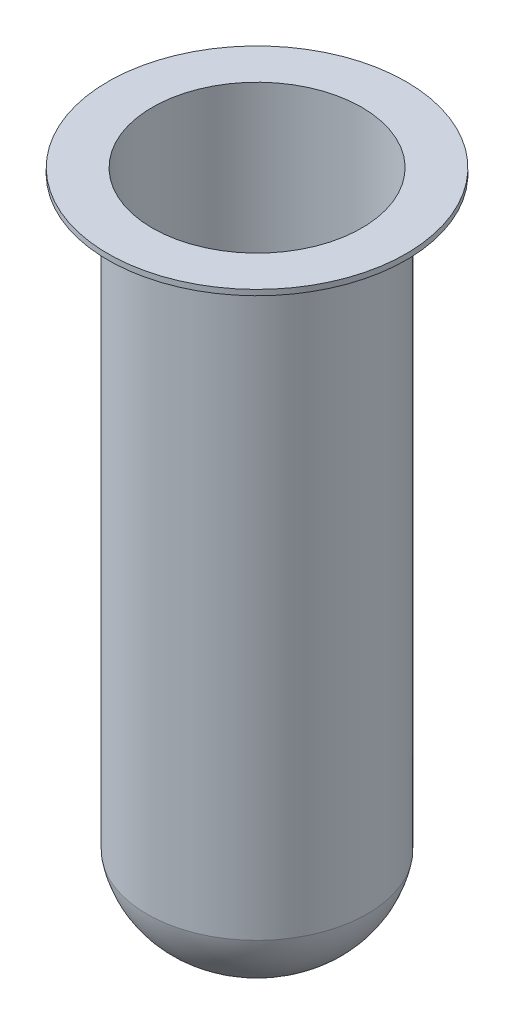
ISO-10303-21;
HEADER;
FILE_DESCRIPTION(('STEP AP214'),'2;1');
FILE_NAME('part.step','',(''),(''),'','','');
FILE_SCHEMA(('AUTOMOTIVE_DESIGN { 1 0 10303 214 1 1 1 1 }'));
ENDSEC;
DATA;
#1=APPLICATION_CONTEXT('core data for automotive mechanical design processes');
#2=APPLICATION_PROTOCOL_DEFINITION('international standard','automotive_design',2000,#1);
#3=PRODUCT_CONTEXT('',#1,'mechanical');
#4=PRODUCT('Part','Part','',(#3));
#5=PRODUCT_RELATED_PRODUCT_CATEGORY('part','',(#4));
#6=PRODUCT_DEFINITION_FORMATION('','',#4);
#7=PRODUCT_DEFINITION_CONTEXT('part definition',#1,'design');
#8=PRODUCT_DEFINITION('design','',#6,#7);
#9=PRODUCT_DEFINITION_SHAPE('','',#8);
#10=(LENGTH_UNIT() NAMED_UNIT(*) SI_UNIT(.MILLI.,.METRE.));
#11=(NAMED_UNIT(*) PLANE_ANGLE_UNIT() SI_UNIT($,.RADIAN.));
#12=(NAMED_UNIT(*) SI_UNIT($,.STERADIAN.) SOLID_ANGLE_UNIT());
#13=UNCERTAINTY_MEASURE_WITH_UNIT(LENGTH_MEASURE(1.E-05),#10,'distance_accuracy_value','');
#14=(GEOMETRIC_REPRESENTATION_CONTEXT(3) GLOBAL_UNCERTAINTY_ASSIGNED_CONTEXT((#13)) GLOBAL_UNIT_ASSIGNED_CONTEXT((#10,
#11,#12)) REPRESENTATION_CONTEXT('',''));
#15=CARTESIAN_POINT('',(0.,0.,0.));
#16=DIRECTION('',(0.,0.,1.));
#17=DIRECTION('',(1.,0.,0.));
#18=AXIS2_PLACEMENT_3D('',#15,#16,#17);
#19=CARTESIAN_POINT('',(0.,16.8461439258809,-3.15385607411916));
#20=DIRECTION('',(-1.,0.,0.));
#21=DIRECTION('',(0.,0.,-1.));
#22=AXIS2_PLACEMENT_3D('',#19,#20,#21);
#23=CIRCLE('',#22,17.1388264857239);
#24=TRIMMED_CURVE('',#23,(PARAMETER_VALUE(-1.75586924229141)),
(PARAMETER_VALUE(1.75586924229141)),.T.,.PARAMETER.);
#25=CARTESIAN_POINT('',(0.,16.8461439258809,0.));
#26=DIRECTION('',(0.,-1.,0.));
#27=AXIS1_PLACEMENT('',#25,#26);
#28=SURFACE_OF_REVOLUTION('',#24,#27);
#29=CARTESIAN_POINT('',(0.,13.6922878517616,0.));
#30=DIRECTION('',(0.,-1.,0.));
#31=DIRECTION('',(0.,0.,-1.));
#32=AXIS2_PLACEMENT_3D('',#29,#30,#31);
#33=CIRCLE('',#32,20.);
#34=CARTESIAN_POINT('',(0.,13.6922878517616,-20.));
#35=VERTEX_POINT('',#34);
#36=EDGE_CURVE('E77',#35,#35,#33,.T.);
#37=ORIENTED_EDGE('',*,*,#36,.T.);
#38=EDGE_LOOP('',(#37));
#39=FACE_BOUND('',#38,.T.);
#40=CARTESIAN_POINT('',(0.,0.,0.));
#41=VERTEX_POINT('',#40);
#42=VERTEX_LOOP('',#41);
#43=FACE_BOUND('',#42,.T.);
#44=ADVANCED_FACE('F38',(#39,#43),#28,.T.);
#45=CARTESIAN_POINT('',(0.,0.982922835464445,0.));
#46=DIRECTION('',(0.,1.,0.));
#47=DIRECTION('',(0.,0.,1.));
#48=AXIS2_PLACEMENT_3D('',#45,#46,#47);
#49=CONICAL_SURFACE('',#48,0.184018204323746,1.28900715481692);
#50=CARTESIAN_POINT('',(0.,0.929650956663863,0.));
#51=VERTEX_POINT('',#50);
#52=VERTEX_LOOP('',#51);
#53=FACE_BOUND('',#52,.T.);
#54=CARTESIAN_POINT('',(0.,0.982922835464445,0.));
#55=DIRECTION('',(0.,-1.,0.));
#56=DIRECTION('',(0.,0.,-1.));
#57=AXIS2_PLACEMENT_3D('',#54,#55,#56);
#58=CIRCLE('',#57,0.184018204323746);
#59=CARTESIAN_POINT('',(0.,0.982922835464445,-0.184018204323746));
#60=VERTEX_POINT('',#59);
#61=EDGE_CURVE('E11',#60,#60,#58,.T.);
#62=ORIENTED_EDGE('',*,*,#61,.F.);
#63=EDGE_LOOP('',(#62));
#64=FACE_BOUND('',#63,.T.);
#65=ADVANCED_FACE('F51',(#53,#64),#49,.F.);
#66=CARTESIAN_POINT('',(0.,16.8461439258809,0.));
#67=DIRECTION('',(0.,-1.,0.));
#68=DIRECTION('',(0.,0.,-1.));
#69=AXIS2_PLACEMENT_3D('',#66,#67,#68);
#70=DEGENERATE_TOROIDAL_SURFACE('',#69,3.15385607411916,16.1388264857239,.T.);
#71=ORIENTED_EDGE('',*,*,#61,.T.);
#72=EDGE_LOOP('',(#71));
#73=FACE_BOUND('',#72,.T.);
#74=CARTESIAN_POINT('',(0.,13.786496394453,0.));
#75=DIRECTION('',(0.,-1.,0.));
#76=DIRECTION('',(0.,0.,-1.));
#77=AXIS2_PLACEMENT_3D('',#74,#75,#76);
#78=CIRCLE('',#77,19.);
#79=CARTESIAN_POINT('',(0.,13.786496394453,-19.));
#80=VERTEX_POINT('',#79);
#81=EDGE_CURVE('E45',#80,#80,#78,.T.);
#82=ORIENTED_EDGE('',*,*,#81,.F.);
#83=EDGE_LOOP('',(#82));
#84=FACE_BOUND('',#83,.T.);
#85=ADVANCED_FACE('F54',(#73,#84),#70,.F.);
#86=CARTESIAN_POINT('',(0.,0.,0.));
#87=DIRECTION('',(0.,-1.,0.));
#88=DIRECTION('',(0.,0.,-1.));
#89=AXIS2_PLACEMENT_3D('',#86,#87,#88);
#90=CYLINDRICAL_SURFACE('',#89,19.);
#91=ORIENTED_EDGE('',*,*,#81,.T.);
#92=EDGE_LOOP('',(#91));
#93=FACE_BOUND('',#92,.T.);
#94=CARTESIAN_POINT('',(0.,121.,0.));
#95=DIRECTION('',(0.,-1.,0.));
#96=DIRECTION('',(0.,0.,-1.));
#97=AXIS2_PLACEMENT_3D('',#94,#95,#96);
#98=CIRCLE('',#97,19.);
#99=CARTESIAN_POINT('',(0.,121.,-19.));
#100=VERTEX_POINT('',#99);
#101=EDGE_CURVE('E64',#100,#100,#98,.T.);
#102=ORIENTED_EDGE('',*,*,#101,.F.);
#103=EDGE_LOOP('',(#102));
#104=FACE_BOUND('',#103,.T.);
#105=ADVANCED_FACE('F59',(#93,#104),#90,.F.);
#106=CARTESIAN_POINT('',(19.,121.,0.));
#107=DIRECTION('',(0.,1.,0.));
#108=DIRECTION('',(0.,0.,1.));
#109=AXIS2_PLACEMENT_3D('',#106,#107,#108);
#110=PLANE('',#109);
#111=ORIENTED_EDGE('',*,*,#101,.T.);
#112=EDGE_LOOP('',(#111));
#113=FACE_BOUND('',#112,.T.);
#114=CARTESIAN_POINT('',(0.,121.,0.));
#115=DIRECTION('',(0.,-1.,0.));
#116=DIRECTION('',(0.,0.,-1.));
#117=AXIS2_PLACEMENT_3D('',#114,#115,#116);
#118=CIRCLE('',#117,27.0598087421604);
#119=CARTESIAN_POINT('',(0.,121.,-27.0598087421604));
#120=VERTEX_POINT('',#119);
#121=EDGE_CURVE('E66',#120,#120,#118,.T.);
#122=ORIENTED_EDGE('',*,*,#121,.F.);
#123=EDGE_LOOP('',(#122));
#124=FACE_BOUND('',#123,.T.);
#125=ADVANCED_FACE('F110',(#113,#124),#110,.T.);
#126=CARTESIAN_POINT('',(0.,0.,0.));
#127=DIRECTION('',(0.,-1.,0.));
#128=DIRECTION('',(0.,0.,-1.));
#129=AXIS2_PLACEMENT_3D('',#126,#127,#128);
#130=CYLINDRICAL_SURFACE('',#129,27.0598087421604);
#131=ORIENTED_EDGE('',*,*,#121,.T.);
#132=EDGE_LOOP('',(#131));
#133=FACE_BOUND('',#132,.T.);
#134=CARTESIAN_POINT('',(0.,120.,0.));
#135=DIRECTION('',(0.,-1.,0.));
#136=DIRECTION('',(0.,0.,-1.));
#137=AXIS2_PLACEMENT_3D('',#134,#135,#136);
#138=CIRCLE('',#137,27.0598087421604);
#139=CARTESIAN_POINT('',(0.,120.,-27.0598087421604));
#140=VERTEX_POINT('',#139);
#141=EDGE_CURVE('E71',#140,#140,#138,.T.);
#142=ORIENTED_EDGE('',*,*,#141,.F.);
#143=EDGE_LOOP('',(#142));
#144=FACE_BOUND('',#143,.T.);
#145=ADVANCED_FACE('F90',(#133,#144),#130,.T.);
#146=CARTESIAN_POINT('',(20.,120.,0.));
#147=DIRECTION('',(0.,-1.,0.));
#148=DIRECTION('',(0.,0.,-1.));
#149=AXIS2_PLACEMENT_3D('',#146,#147,#148);
#150=PLANE('',#149);
#151=ORIENTED_EDGE('',*,*,#141,.T.);
#152=EDGE_LOOP('',(#151));
#153=FACE_BOUND('',#152,.T.);
#154=CARTESIAN_POINT('',(0.,120.,0.));
#155=DIRECTION('',(0.,-1.,0.));
#156=DIRECTION('',(0.,0.,-1.));
#157=AXIS2_PLACEMENT_3D('',#154,#155,#156);
#158=CIRCLE('',#157,20.);
#159=CARTESIAN_POINT('',(0.,120.,-20.));
#160=VERTEX_POINT('',#159);
#161=EDGE_CURVE('E74',#160,#160,#158,.T.);
#162=ORIENTED_EDGE('',*,*,#161,.F.);
#163=EDGE_LOOP('',(#162));
#164=FACE_BOUND('',#163,.T.);
#165=ADVANCED_FACE('F84',(#153,#164),#150,.T.);
#166=CARTESIAN_POINT('',(0.,0.,0.));
#167=DIRECTION('',(0.,-1.,0.));
#168=DIRECTION('',(0.,0.,-1.));
#169=AXIS2_PLACEMENT_3D('',#166,#167,#168);
#170=CYLINDRICAL_SURFACE('',#169,20.);
#171=ORIENTED_EDGE('',*,*,#161,.T.);
#172=EDGE_LOOP('',(#171));
#173=FACE_BOUND('',#172,.T.);
#174=ORIENTED_EDGE('',*,*,#36,.F.);
#175=EDGE_LOOP('',(#174));
#176=FACE_BOUND('',#175,.T.);
#177=ADVANCED_FACE('F82',(#173,#176),#170,.T.);
#178=CLOSED_SHELL('',(#44,#65,#85,#105,#125,#145,#165,#177));
#179=MANIFOLD_SOLID_BREP('B2',#178);
#180=ADVANCED_BREP_SHAPE_REPRESENTATION('',(#18,#179),#14);
#181=SHAPE_DEFINITION_REPRESENTATION(#9,#180);
ENDSEC;
END-ISO-10303-21;
